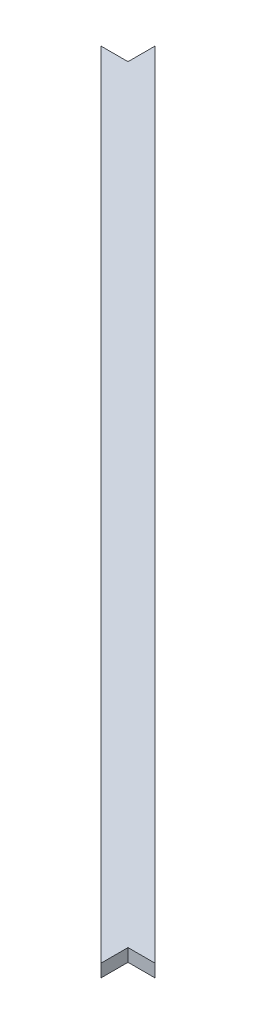
ISO-10303-21;
HEADER;
FILE_DESCRIPTION(('STEP AP214'),'2;1');
FILE_NAME('part.step','',(''),(''),'','','');
FILE_SCHEMA(('AUTOMOTIVE_DESIGN { 1 0 10303 214 1 1 1 1 }'));
ENDSEC;
DATA;
#1=APPLICATION_CONTEXT('core data for automotive mechanical design processes');
#2=APPLICATION_PROTOCOL_DEFINITION('international standard','automotive_design',2000,#1);
#3=PRODUCT_CONTEXT('',#1,'mechanical');
#4=PRODUCT('Part','Part','',(#3));
#5=PRODUCT_RELATED_PRODUCT_CATEGORY('part','',(#4));
#6=PRODUCT_DEFINITION_FORMATION('','',#4);
#7=PRODUCT_DEFINITION_CONTEXT('part definition',#1,'design');
#8=PRODUCT_DEFINITION('design','',#6,#7);
#9=PRODUCT_DEFINITION_SHAPE('','',#8);
#10=(LENGTH_UNIT() NAMED_UNIT(*) SI_UNIT(.MILLI.,.METRE.));
#11=(NAMED_UNIT(*) PLANE_ANGLE_UNIT() SI_UNIT($,.RADIAN.));
#12=(NAMED_UNIT(*) SI_UNIT($,.STERADIAN.) SOLID_ANGLE_UNIT());
#13=UNCERTAINTY_MEASURE_WITH_UNIT(LENGTH_MEASURE(1.E-05),#10,'distance_accuracy_value','');
#14=(GEOMETRIC_REPRESENTATION_CONTEXT(3) GLOBAL_UNCERTAINTY_ASSIGNED_CONTEXT((#13)) GLOBAL_UNIT_ASSIGNED_CONTEXT((#10,
#11,#12)) REPRESENTATION_CONTEXT('',''));
#15=CARTESIAN_POINT('',(0.,0.,0.));
#16=DIRECTION('',(0.,0.,1.));
#17=DIRECTION('',(1.,0.,0.));
#18=AXIS2_PLACEMENT_3D('',#15,#16,#17);
#19=CARTESIAN_POINT('',(-380.95,12.7,-380.95));
#20=DIRECTION('',(0.,0.,1.));
#21=DIRECTION('',(1.,0.,0.));
#22=AXIS2_PLACEMENT_3D('',#19,#20,#21);
#23=PLANE('',#22);
#24=DIRECTION('',(-1.,0.,0.));
#25=VECTOR('',#24,1.);
#26=CARTESIAN_POINT('',(-380.95,0.,-380.95));
#27=LINE('',#26,#25);
#28=CARTESIAN_POINT('',(-380.95,0.,-380.95));
#29=VERTEX_POINT('',#28);
#30=CARTESIAN_POINT('',(-407.890768363208,0.,-380.95));
#31=VERTEX_POINT('',#30);
#32=EDGE_CURVE('E126',#29,#31,#27,.T.);
#33=ORIENTED_EDGE('',*,*,#32,.T.);
#34=DIRECTION('',(0.,-1.,0.));
#35=VECTOR('',#34,1.);
#36=CARTESIAN_POINT('',(-407.890768363208,12.7,-380.95));
#37=LINE('',#36,#35);
#38=CARTESIAN_POINT('',(-407.890768363208,12.7,-380.95));
#39=VERTEX_POINT('',#38);
#40=EDGE_CURVE('E11',#39,#31,#37,.T.);
#41=ORIENTED_EDGE('',*,*,#40,.F.);
#42=DIRECTION('',(-1.,0.,0.));
#43=VECTOR('',#42,1.);
#44=CARTESIAN_POINT('',(-380.95,12.7,-380.95));
#45=LINE('',#44,#43);
#46=CARTESIAN_POINT('',(-380.95,12.7,-380.95));
#47=VERTEX_POINT('',#46);
#48=EDGE_CURVE('E142',#47,#39,#45,.T.);
#49=ORIENTED_EDGE('',*,*,#48,.F.);
#50=DIRECTION('',(0.,-1.,0.));
#51=VECTOR('',#50,1.);
#52=CARTESIAN_POINT('',(-380.95,12.7,-380.95));
#53=LINE('',#52,#51);
#54=EDGE_CURVE('E122',#47,#29,#53,.T.);
#55=ORIENTED_EDGE('',*,*,#54,.T.);
#56=EDGE_LOOP('',(#33,#41,#49,#55));
#57=FACE_BOUND('',#56,.T.);
#58=ADVANCED_FACE('F37',(#57),#23,.F.);
#59=CARTESIAN_POINT('',(-407.890768363208,12.7,-380.95));
#60=DIRECTION('',(0.707106781186547,0.,-0.707106781186548));
#61=DIRECTION('',(-0.707106781186548,0.,-0.707106781186547));
#62=AXIS2_PLACEMENT_3D('',#59,#60,#61);
#63=PLANE('',#62);
#64=DIRECTION('',(0.707106781186548,0.,0.707106781186547));
#65=VECTOR('',#64,1.);
#66=CARTESIAN_POINT('',(-407.890768363208,0.,-380.95));
#67=LINE('',#66,#65);
#68=CARTESIAN_POINT('',(380.95,0.,407.890768363208));
#69=VERTEX_POINT('',#68);
#70=EDGE_CURVE('E130',#31,#69,#67,.T.);
#71=ORIENTED_EDGE('',*,*,#70,.T.);
#72=DIRECTION('',(0.,-1.,0.));
#73=VECTOR('',#72,1.);
#74=CARTESIAN_POINT('',(380.95,12.7,407.890768363208));
#75=LINE('',#74,#73);
#76=CARTESIAN_POINT('',(380.95,12.7,407.890768363208));
#77=VERTEX_POINT('',#76);
#78=EDGE_CURVE('E46',#77,#69,#75,.T.);
#79=ORIENTED_EDGE('',*,*,#78,.F.);
#80=DIRECTION('',(0.707106781186548,0.,0.707106781186547));
#81=VECTOR('',#80,1.);
#82=CARTESIAN_POINT('',(-407.890768363208,12.7,-380.95));
#83=LINE('',#82,#81);
#84=EDGE_CURVE('E91',#39,#77,#83,.T.);
#85=ORIENTED_EDGE('',*,*,#84,.F.);
#86=ORIENTED_EDGE('',*,*,#40,.T.);
#87=EDGE_LOOP('',(#71,#79,#85,#86));
#88=FACE_BOUND('',#87,.T.);
#89=ADVANCED_FACE('F170',(#88),#63,.F.);
#90=CARTESIAN_POINT('',(380.95,12.7,407.890768363208));
#91=DIRECTION('',(-1.,0.,0.));
#92=DIRECTION('',(0.,0.,1.));
#93=AXIS2_PLACEMENT_3D('',#90,#91,#92);
#94=PLANE('',#93);
#95=DIRECTION('',(0.,0.,-1.));
#96=VECTOR('',#95,1.);
#97=CARTESIAN_POINT('',(380.95,0.,407.890768363208));
#98=LINE('',#97,#96);
#99=CARTESIAN_POINT('',(380.95,0.,380.95));
#100=VERTEX_POINT('',#99);
#101=EDGE_CURVE('E133',#69,#100,#98,.T.);
#102=ORIENTED_EDGE('',*,*,#101,.T.);
#103=DIRECTION('',(0.,-1.,0.));
#104=VECTOR('',#103,1.);
#105=CARTESIAN_POINT('',(380.95,12.7,380.95));
#106=LINE('',#105,#104);
#107=CARTESIAN_POINT('',(380.95,12.7,380.95));
#108=VERTEX_POINT('',#107);
#109=EDGE_CURVE('E115',#108,#100,#106,.T.);
#110=ORIENTED_EDGE('',*,*,#109,.F.);
#111=DIRECTION('',(0.,0.,-1.));
#112=VECTOR('',#111,1.);
#113=CARTESIAN_POINT('',(380.95,12.7,407.890768363208));
#114=LINE('',#113,#112);
#115=EDGE_CURVE('E104',#77,#108,#114,.T.);
#116=ORIENTED_EDGE('',*,*,#115,.F.);
#117=ORIENTED_EDGE('',*,*,#78,.T.);
#118=EDGE_LOOP('',(#102,#110,#116,#117));
#119=FACE_BOUND('',#118,.T.);
#120=ADVANCED_FACE('F152',(#119),#94,.F.);
#121=CARTESIAN_POINT('',(380.95,12.7,380.95));
#122=DIRECTION('',(0.,0.,-1.));
#123=DIRECTION('',(-1.,0.,0.));
#124=AXIS2_PLACEMENT_3D('',#121,#122,#123);
#125=PLANE('',#124);
#126=DIRECTION('',(1.,0.,0.));
#127=VECTOR('',#126,1.);
#128=CARTESIAN_POINT('',(380.95,0.,380.95));
#129=LINE('',#128,#127);
#130=CARTESIAN_POINT('',(407.890768363207,0.,380.95));
#131=VERTEX_POINT('',#130);
#132=EDGE_CURVE('E113',#100,#131,#129,.T.);
#133=ORIENTED_EDGE('',*,*,#132,.T.);
#134=DIRECTION('',(0.,-1.,0.));
#135=VECTOR('',#134,1.);
#136=CARTESIAN_POINT('',(407.890768363207,12.7,380.95));
#137=LINE('',#136,#135);
#138=CARTESIAN_POINT('',(407.890768363207,12.7,380.95));
#139=VERTEX_POINT('',#138);
#140=EDGE_CURVE('E110',#139,#131,#137,.T.);
#141=ORIENTED_EDGE('',*,*,#140,.F.);
#142=DIRECTION('',(1.,0.,0.));
#143=VECTOR('',#142,1.);
#144=CARTESIAN_POINT('',(380.95,12.7,380.95));
#145=LINE('',#144,#143);
#146=EDGE_CURVE('E98',#108,#139,#145,.T.);
#147=ORIENTED_EDGE('',*,*,#146,.F.);
#148=ORIENTED_EDGE('',*,*,#109,.T.);
#149=EDGE_LOOP('',(#133,#141,#147,#148));
#150=FACE_BOUND('',#149,.T.);
#151=ADVANCED_FACE('F111',(#150),#125,.F.);
#152=CARTESIAN_POINT('',(407.890768363207,12.7,380.95));
#153=DIRECTION('',(-0.707106781186547,0.,0.707106781186548));
#154=DIRECTION('',(0.707106781186548,0.,0.707106781186547));
#155=AXIS2_PLACEMENT_3D('',#152,#153,#154);
#156=PLANE('',#155);
#157=DIRECTION('',(-0.707106781186548,0.,-0.707106781186547));
#158=VECTOR('',#157,1.);
#159=CARTESIAN_POINT('',(407.890768363207,0.,380.95));
#160=LINE('',#159,#158);
#161=CARTESIAN_POINT('',(-380.95,0.,-407.890768363207));
#162=VERTEX_POINT('',#161);
#163=EDGE_CURVE('E77',#131,#162,#160,.T.);
#164=ORIENTED_EDGE('',*,*,#163,.T.);
#165=DIRECTION('',(0.,-1.,0.));
#166=VECTOR('',#165,1.);
#167=CARTESIAN_POINT('',(-380.95,12.7,-407.890768363207));
#168=LINE('',#167,#166);
#169=CARTESIAN_POINT('',(-380.95,12.7,-407.890768363207));
#170=VERTEX_POINT('',#169);
#171=EDGE_CURVE('E116',#170,#162,#168,.T.);
#172=ORIENTED_EDGE('',*,*,#171,.F.);
#173=DIRECTION('',(-0.707106781186548,0.,-0.707106781186547));
#174=VECTOR('',#173,1.);
#175=CARTESIAN_POINT('',(407.890768363207,12.7,380.95));
#176=LINE('',#175,#174);
#177=EDGE_CURVE('E102',#139,#170,#176,.T.);
#178=ORIENTED_EDGE('',*,*,#177,.F.);
#179=ORIENTED_EDGE('',*,*,#140,.T.);
#180=EDGE_LOOP('',(#164,#172,#178,#179));
#181=FACE_BOUND('',#180,.T.);
#182=ADVANCED_FACE('F118',(#181),#156,.F.);
#183=CARTESIAN_POINT('',(-380.95,12.7,-407.890768363207));
#184=DIRECTION('',(1.,0.,0.));
#185=DIRECTION('',(0.,0.,-1.));
#186=AXIS2_PLACEMENT_3D('',#183,#184,#185);
#187=PLANE('',#186);
#188=DIRECTION('',(0.,0.,1.));
#189=VECTOR('',#188,1.);
#190=CARTESIAN_POINT('',(-380.95,0.,-407.890768363207));
#191=LINE('',#190,#189);
#192=EDGE_CURVE('E83',#162,#29,#191,.T.);
#193=ORIENTED_EDGE('',*,*,#192,.T.);
#194=ORIENTED_EDGE('',*,*,#54,.F.);
#195=DIRECTION('',(0.,0.,1.));
#196=VECTOR('',#195,1.);
#197=CARTESIAN_POINT('',(-380.95,12.7,-407.890768363207));
#198=LINE('',#197,#196);
#199=EDGE_CURVE('E54',#170,#47,#198,.T.);
#200=ORIENTED_EDGE('',*,*,#199,.F.);
#201=ORIENTED_EDGE('',*,*,#171,.T.);
#202=EDGE_LOOP('',(#193,#194,#200,#201));
#203=FACE_BOUND('',#202,.T.);
#204=ADVANCED_FACE('F159',(#203),#187,.F.);
#205=CARTESIAN_POINT('',(0.,12.7,0.));
#206=DIRECTION('',(0.,-1.,0.));
#207=DIRECTION('',(0.,0.,-1.));
#208=AXIS2_PLACEMENT_3D('',#205,#206,#207);
#209=PLANE('',#208);
#210=ORIENTED_EDGE('',*,*,#48,.T.);
#211=ORIENTED_EDGE('',*,*,#84,.T.);
#212=ORIENTED_EDGE('',*,*,#115,.T.);
#213=ORIENTED_EDGE('',*,*,#146,.T.);
#214=ORIENTED_EDGE('',*,*,#177,.T.);
#215=ORIENTED_EDGE('',*,*,#199,.T.);
#216=EDGE_LOOP('',(#210,#211,#212,#213,#214,#215));
#217=FACE_BOUND('',#216,.T.);
#218=ADVANCED_FACE('F100',(#217),#209,.F.);
#219=CARTESIAN_POINT('',(0.,0.,0.));
#220=DIRECTION('',(0.,-1.,0.));
#221=DIRECTION('',(0.,0.,-1.));
#222=AXIS2_PLACEMENT_3D('',#219,#220,#221);
#223=PLANE('',#222);
#224=ORIENTED_EDGE('',*,*,#32,.F.);
#225=ORIENTED_EDGE('',*,*,#192,.F.);
#226=ORIENTED_EDGE('',*,*,#163,.F.);
#227=ORIENTED_EDGE('',*,*,#132,.F.);
#228=ORIENTED_EDGE('',*,*,#101,.F.);
#229=ORIENTED_EDGE('',*,*,#70,.F.);
#230=EDGE_LOOP('',(#224,#225,#226,#227,#228,#229));
#231=FACE_BOUND('',#230,.T.);
#232=ADVANCED_FACE('F155',(#231),#223,.T.);
#233=CLOSED_SHELL('',(#58,#89,#120,#151,#182,#204,#218,#232));
#234=MANIFOLD_SOLID_BREP('B2',#233);
#235=ADVANCED_BREP_SHAPE_REPRESENTATION('',(#18,#234),#14);
#236=SHAPE_DEFINITION_REPRESENTATION(#9,#235);
ENDSEC;
END-ISO-10303-21;
